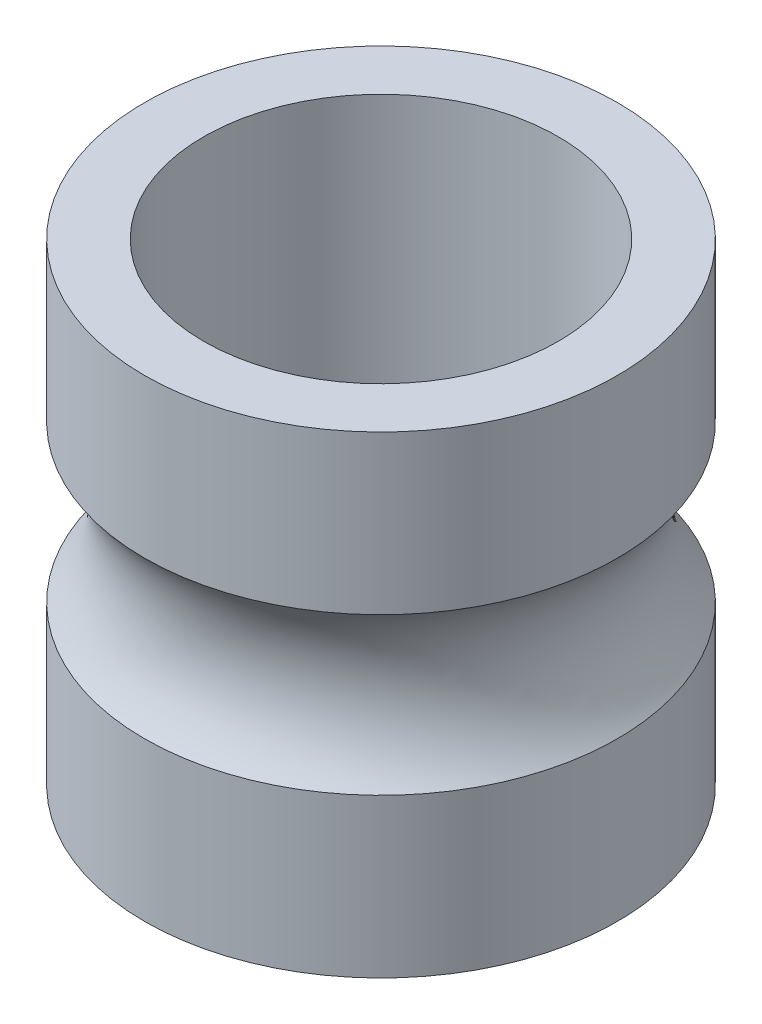
ISO-10303-21;
HEADER;
FILE_DESCRIPTION(('STEP AP214'),'2;1');
FILE_NAME('part.step','',(''),(''),'','','');
FILE_SCHEMA(('AUTOMOTIVE_DESIGN { 1 0 10303 214 1 1 1 1 }'));
ENDSEC;
DATA;
#1=APPLICATION_CONTEXT('core data for automotive mechanical design processes');
#2=APPLICATION_PROTOCOL_DEFINITION('international standard','automotive_design',2000,#1);
#3=PRODUCT_CONTEXT('',#1,'mechanical');
#4=PRODUCT('Part','Part','',(#3));
#5=PRODUCT_RELATED_PRODUCT_CATEGORY('part','',(#4));
#6=PRODUCT_DEFINITION_FORMATION('','',#4);
#7=PRODUCT_DEFINITION_CONTEXT('part definition',#1,'design');
#8=PRODUCT_DEFINITION('design','',#6,#7);
#9=PRODUCT_DEFINITION_SHAPE('','',#8);
#10=(LENGTH_UNIT() NAMED_UNIT(*) SI_UNIT(.MILLI.,.METRE.));
#11=(NAMED_UNIT(*) PLANE_ANGLE_UNIT() SI_UNIT($,.RADIAN.));
#12=(NAMED_UNIT(*) SI_UNIT($,.STERADIAN.) SOLID_ANGLE_UNIT());
#13=UNCERTAINTY_MEASURE_WITH_UNIT(LENGTH_MEASURE(1.E-05),#10,'distance_accuracy_value','');
#14=(GEOMETRIC_REPRESENTATION_CONTEXT(3) GLOBAL_UNCERTAINTY_ASSIGNED_CONTEXT((#13)) GLOBAL_UNIT_ASSIGNED_CONTEXT((#10,
#11,#12)) REPRESENTATION_CONTEXT('',''));
#15=CARTESIAN_POINT('',(0.,0.,0.));
#16=DIRECTION('',(0.,0.,1.));
#17=DIRECTION('',(1.,0.,0.));
#18=AXIS2_PLACEMENT_3D('',#15,#16,#17);
#19=CARTESIAN_POINT('',(0.,2.,0.));
#20=DIRECTION('',(0.,-1.,0.));
#21=DIRECTION('',(0.,0.,-1.));
#22=AXIS2_PLACEMENT_3D('',#19,#20,#21);
#23=CYLINDRICAL_SURFACE('',#22,2.);
#24=CARTESIAN_POINT('',(0.,2.,0.));
#25=DIRECTION('',(0.,1.,0.));
#26=DIRECTION('',(0.,0.,1.));
#27=AXIS2_PLACEMENT_3D('',#24,#25,#26);
#28=CIRCLE('',#27,2.);
#29=CARTESIAN_POINT('',(0.,2.,2.));
#30=VERTEX_POINT('',#29);
#31=EDGE_CURVE('E10',#30,#30,#28,.T.);
#32=ORIENTED_EDGE('',*,*,#31,.F.);
#33=EDGE_LOOP('',(#32));
#34=FACE_BOUND('',#33,.T.);
#35=CARTESIAN_POINT('',(0.,0.661437827766148,0.));
#36=DIRECTION('',(0.,-1.,0.));
#37=DIRECTION('',(0.,0.,-1.));
#38=AXIS2_PLACEMENT_3D('',#35,#36,#37);
#39=CIRCLE('',#38,2.);
#40=CARTESIAN_POINT('',(0.,0.661437827766148,-2.));
#41=VERTEX_POINT('',#40);
#42=EDGE_CURVE('E39',#41,#41,#39,.T.);
#43=ORIENTED_EDGE('',*,*,#42,.F.);
#44=EDGE_LOOP('',(#43));
#45=FACE_BOUND('',#44,.T.);
#46=ADVANCED_FACE('F36',(#34,#45),#23,.T.);
#47=CARTESIAN_POINT('',(0.,-2.,0.));
#48=DIRECTION('',(0.,1.,0.));
#49=DIRECTION('',(0.,0.,1.));
#50=AXIS2_PLACEMENT_3D('',#47,#48,#49);
#51=CIRCLE('',#50,2.);
#52=CARTESIAN_POINT('',(0.,-2.,2.));
#53=VERTEX_POINT('',#52);
#54=EDGE_CURVE('E44',#53,#53,#51,.T.);
#55=ORIENTED_EDGE('',*,*,#54,.T.);
#56=EDGE_LOOP('',(#55));
#57=FACE_BOUND('',#56,.T.);
#58=CARTESIAN_POINT('',(0.,-0.661437827766148,0.));
#59=DIRECTION('',(0.,1.,0.));
#60=DIRECTION('',(0.,0.,1.));
#61=AXIS2_PLACEMENT_3D('',#58,#59,#60);
#62=CIRCLE('',#61,2.);
#63=CARTESIAN_POINT('',(0.,-0.661437827766148,2.));
#64=VERTEX_POINT('',#63);
#65=EDGE_CURVE('E56',#64,#64,#62,.T.);
#66=ORIENTED_EDGE('',*,*,#65,.F.);
#67=EDGE_LOOP('',(#66));
#68=FACE_BOUND('',#67,.T.);
#69=ADVANCED_FACE('F78',(#57,#68),#23,.T.);
#70=CARTESIAN_POINT('',(0.,2.,0.));
#71=DIRECTION('',(0.,1.,0.));
#72=DIRECTION('',(0.,0.,1.));
#73=AXIS2_PLACEMENT_3D('',#70,#71,#72);
#74=PLANE('',#73);
#75=ORIENTED_EDGE('',*,*,#31,.T.);
#76=EDGE_LOOP('',(#75));
#77=FACE_BOUND('',#76,.T.);
#78=CARTESIAN_POINT('',(0.,2.,0.));
#79=DIRECTION('',(0.,1.,0.));
#80=DIRECTION('',(0.,0.,1.));
#81=AXIS2_PLACEMENT_3D('',#78,#79,#80);
#82=CIRCLE('',#81,1.5);
#83=CARTESIAN_POINT('',(0.,2.,1.5));
#84=VERTEX_POINT('',#83);
#85=EDGE_CURVE('E51',#84,#84,#82,.T.);
#86=ORIENTED_EDGE('',*,*,#85,.F.);
#87=EDGE_LOOP('',(#86));
#88=FACE_BOUND('',#87,.T.);
#89=ADVANCED_FACE('F75',(#77,#88),#74,.T.);
#90=CARTESIAN_POINT('',(0.,-2.,0.));
#91=DIRECTION('',(0.,1.,0.));
#92=DIRECTION('',(0.,0.,1.));
#93=AXIS2_PLACEMENT_3D('',#90,#91,#92);
#94=PLANE('',#93);
#95=ORIENTED_EDGE('',*,*,#54,.F.);
#96=EDGE_LOOP('',(#95));
#97=FACE_BOUND('',#96,.T.);
#98=CARTESIAN_POINT('',(0.,-2.,0.));
#99=DIRECTION('',(0.,1.,0.));
#100=DIRECTION('',(0.,0.,1.));
#101=AXIS2_PLACEMENT_3D('',#98,#99,#100);
#102=CIRCLE('',#101,1.5);
#103=CARTESIAN_POINT('',(0.,-2.,1.5));
#104=VERTEX_POINT('',#103);
#105=EDGE_CURVE('E54',#104,#104,#102,.T.);
#106=ORIENTED_EDGE('',*,*,#105,.T.);
#107=EDGE_LOOP('',(#106));
#108=FACE_BOUND('',#107,.T.);
#109=ADVANCED_FACE('F77',(#97,#108),#94,.F.);
#110=CARTESIAN_POINT('',(0.,2.,0.));
#111=DIRECTION('',(0.,-1.,0.));
#112=DIRECTION('',(0.,0.,-1.));
#113=AXIS2_PLACEMENT_3D('',#110,#111,#112);
#114=CYLINDRICAL_SURFACE('',#113,1.5);
#115=ORIENTED_EDGE('',*,*,#85,.T.);
#116=EDGE_LOOP('',(#115));
#117=FACE_BOUND('',#116,.T.);
#118=ORIENTED_EDGE('',*,*,#105,.F.);
#119=EDGE_LOOP('',(#118));
#120=FACE_BOUND('',#119,.T.);
#121=ADVANCED_FACE('F72',(#117,#120),#114,.F.);
#122=CARTESIAN_POINT('',(0.,0.,0.));
#123=DIRECTION('',(0.,1.,0.));
#124=DIRECTION('',(0.,0.,1.));
#125=AXIS2_PLACEMENT_3D('',#122,#123,#124);
#126=TOROIDAL_SURFACE('',#125,2.75,1.);
#127=ORIENTED_EDGE('',*,*,#65,.T.);
#128=EDGE_LOOP('',(#127));
#129=FACE_BOUND('',#128,.T.);
#130=ORIENTED_EDGE('',*,*,#42,.T.);
#131=EDGE_LOOP('',(#130));
#132=FACE_BOUND('',#131,.T.);
#133=ADVANCED_FACE('F111',(#129,#132),#126,.F.);
#134=CLOSED_SHELL('',(#46,#69,#89,#109,#121,#133));
#135=MANIFOLD_SOLID_BREP('B2',#134);
#136=ADVANCED_BREP_SHAPE_REPRESENTATION('',(#18,#135),#14);
#137=SHAPE_DEFINITION_REPRESENTATION(#9,#136);
ENDSEC;
END-ISO-10303-21;
